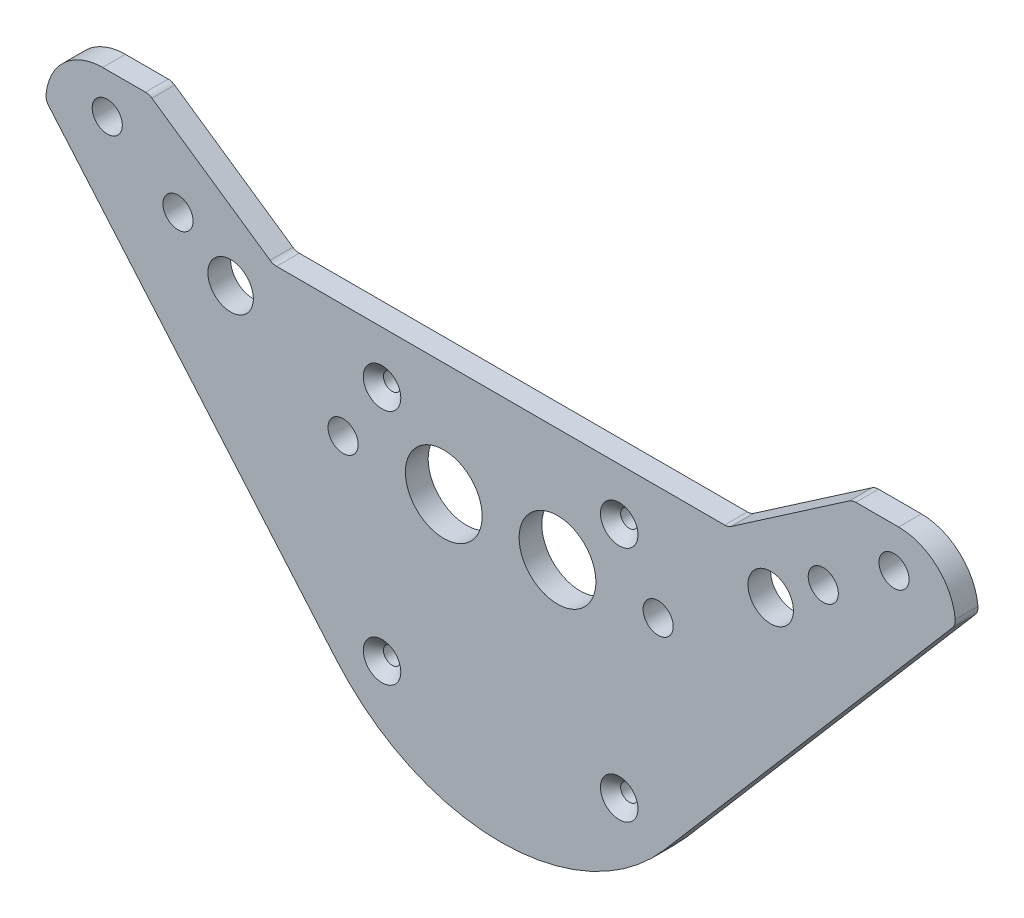
ISO-10303-21;
HEADER;
FILE_DESCRIPTION(('STEP AP214'),'2;1');
FILE_NAME('part.step','',(''),(''),'','','');
FILE_SCHEMA(('AUTOMOTIVE_DESIGN { 1 0 10303 214 1 1 1 1 }'));
ENDSEC;
DATA;
#1=APPLICATION_CONTEXT('core data for automotive mechanical design processes');
#2=APPLICATION_PROTOCOL_DEFINITION('international standard','automotive_design',2000,#1);
#3=PRODUCT_CONTEXT('',#1,'mechanical');
#4=PRODUCT('Part','Part','',(#3));
#5=PRODUCT_RELATED_PRODUCT_CATEGORY('part','',(#4));
#6=PRODUCT_DEFINITION_FORMATION('','',#4);
#7=PRODUCT_DEFINITION_CONTEXT('part definition',#1,'design');
#8=PRODUCT_DEFINITION('design','',#6,#7);
#9=PRODUCT_DEFINITION_SHAPE('','',#8);
#10=(LENGTH_UNIT() NAMED_UNIT(*) SI_UNIT(.MILLI.,.METRE.));
#11=(NAMED_UNIT(*) PLANE_ANGLE_UNIT() SI_UNIT($,.RADIAN.));
#12=(NAMED_UNIT(*) SI_UNIT($,.STERADIAN.) SOLID_ANGLE_UNIT());
#13=UNCERTAINTY_MEASURE_WITH_UNIT(LENGTH_MEASURE(1.E-05),#10,'distance_accuracy_value','');
#14=(GEOMETRIC_REPRESENTATION_CONTEXT(3) GLOBAL_UNCERTAINTY_ASSIGNED_CONTEXT((#13)) GLOBAL_UNIT_ASSIGNED_CONTEXT((#10,
#11,#12)) REPRESENTATION_CONTEXT('',''));
#15=CARTESIAN_POINT('',(0.,0.,0.));
#16=DIRECTION('',(0.,0.,1.));
#17=DIRECTION('',(1.,0.,0.));
#18=AXIS2_PLACEMENT_3D('',#15,#16,#17);
#19=CARTESIAN_POINT('',(0.,0.,4.));
#20=DIRECTION('',(0.,0.,-1.));
#21=DIRECTION('',(-1.,0.,0.));
#22=AXIS2_PLACEMENT_3D('',#19,#20,#21);
#23=PLANE('',#22);
#24=CARTESIAN_POINT('',(-20.8596500449861,35.8596500450032,4.));
#25=DIRECTION('',(0.,0.,1.));
#26=DIRECTION('',(1.,0.,0.));
#27=AXIS2_PLACEMENT_3D('',#24,#25,#26);
#28=CIRCLE('',#27,3.3);
#29=CARTESIAN_POINT('',(-17.5596500449861,35.8596500450032,4.));
#30=VERTEX_POINT('',#29);
#31=EDGE_CURVE('E707',#30,#30,#28,.T.);
#32=ORIENTED_EDGE('',*,*,#31,.F.);
#33=EDGE_LOOP('',(#32));
#34=FACE_BOUND('',#33,.T.);
#35=DIRECTION('',(-0.824081072987832,0.566471874979883,0.));
#36=VECTOR('',#35,1.);
#37=CARTESIAN_POINT('',(8.16153797644693,11.8730854432979,4.));
#38=LINE('',#37,#36);
#39=CARTESIAN_POINT('',(-40.5420383659888,45.3518378540244,4.));
#40=VERTEX_POINT('',#39);
#41=CARTESIAN_POINT('',(-61.3397704029264,59.6481621459757,4.));
#42=VERTEX_POINT('',#41);
#43=EDGE_CURVE('E211',#40,#42,#38,.T.);
#44=ORIENTED_EDGE('',*,*,#43,.T.);
#45=CARTESIAN_POINT('',(-62.4727141528862,58.,4.));
#46=DIRECTION('',(0.,0.,-1.));
#47=DIRECTION('',(-1.,0.,0.));
#48=AXIS2_PLACEMENT_3D('',#45,#46,#47);
#49=CIRCLE('',#48,2.);
#50=CARTESIAN_POINT('',(-62.4727141528862,60.,4.));
#51=VERTEX_POINT('',#50);
#52=EDGE_CURVE('E320',#42,#51,#49,.F.);
#53=ORIENTED_EDGE('',*,*,#52,.T.);
#54=DIRECTION('',(-1.,0.,0.));
#55=VECTOR('',#54,1.);
#56=CARTESIAN_POINT('',(-80.,60.,4.));
#57=LINE('',#56,#55);
#58=CARTESIAN_POINT('',(-70.,60.,4.));
#59=VERTEX_POINT('',#58);
#60=EDGE_CURVE('E279',#51,#59,#57,.T.);
#61=ORIENTED_EDGE('',*,*,#60,.T.);
#62=CARTESIAN_POINT('',(-70.,50.,4.));
#63=DIRECTION('',(0.,0.,-1.));
#64=DIRECTION('',(-1.,0.,0.));
#65=AXIS2_PLACEMENT_3D('',#62,#63,#64);
#66=CIRCLE('',#65,10.);
#67=CARTESIAN_POINT('',(-79.9612980681539,50.878943000082,4.));
#68=VERTEX_POINT('',#67);
#69=EDGE_CURVE('E292',#59,#68,#66,.F.);
#70=ORIENTED_EDGE('',*,*,#69,.T.);
#71=CARTESIAN_POINT('',(-77.9690384545231,50.7031544000656,4.));
#72=DIRECTION('',(0.,0.,-1.));
#73=DIRECTION('',(-1.,0.,0.));
#74=AXIS2_PLACEMENT_3D('',#71,#72,#73);
#75=CIRCLE('',#74,2.);
#76=CARTESIAN_POINT('',(-79.4881667854191,49.4022896437327,4.));
#77=VERTEX_POINT('',#76);
#78=EDGE_CURVE('E316',#68,#77,#75,.F.);
#79=ORIENTED_EDGE('',*,*,#78,.T.);
#80=DIRECTION('',(0.650432378166486,-0.759564165447982,0.));
#81=VECTOR('',#80,1.);
#82=CARTESIAN_POINT('',(-21.4527613894965,-18.3704961918243,4.));
#83=LINE('',#82,#81);
#84=CARTESIAN_POINT('',(-28.8634382870385,-9.71643037032659,4.));
#85=VERTEX_POINT('',#84);
#86=EDGE_CURVE('E180',#77,#85,#83,.T.);
#87=ORIENTED_EDGE('',*,*,#86,.T.);
#88=CARTESIAN_POINT('',(-1.51250539870418E-11,14.9999999999999,4.));
#89=DIRECTION('',(0.,0.,-1.));
#90=DIRECTION('',(-1.,0.,0.));
#91=AXIS2_PLACEMENT_3D('',#88,#89,#90);
#92=CIRCLE('',#91,38.);
#93=CARTESIAN_POINT('',(28.863438287001,-9.71643037033505,4.));
#94=VERTEX_POINT('',#93);
#95=EDGE_CURVE('E168',#85,#94,#92,.F.);
#96=ORIENTED_EDGE('',*,*,#95,.T.);
#97=DIRECTION('',(0.650432378166708,0.759564165447792,0.));
#98=VECTOR('',#97,1.);
#99=CARTESIAN_POINT('',(21.4527613894712,-18.3704961918135,4.));
#100=LINE('',#99,#98);
#101=CARTESIAN_POINT('',(79.4881667854187,49.4022896437326,4.));
#102=VERTEX_POINT('',#101);
#103=EDGE_CURVE('E184',#94,#102,#100,.T.);
#104=ORIENTED_EDGE('',*,*,#103,.T.);
#105=CARTESIAN_POINT('',(77.9690384545231,50.703154400066,4.));
#106=DIRECTION('',(0.,0.,-1.));
#107=DIRECTION('',(-1.,0.,0.));
#108=AXIS2_PLACEMENT_3D('',#105,#106,#107);
#109=CIRCLE('',#108,2.);
#110=CARTESIAN_POINT('',(79.9612980681539,50.8789430000825,4.));
#111=VERTEX_POINT('',#110);
#112=EDGE_CURVE('E318',#102,#111,#109,.F.);
#113=ORIENTED_EDGE('',*,*,#112,.T.);
#114=CARTESIAN_POINT('',(70.,50.,4.));
#115=DIRECTION('',(0.,0.,-1.));
#116=DIRECTION('',(-1.,0.,0.));
#117=AXIS2_PLACEMENT_3D('',#114,#115,#116);
#118=CIRCLE('',#117,10.);
#119=CARTESIAN_POINT('',(70.,60.,4.));
#120=VERTEX_POINT('',#119);
#121=EDGE_CURVE('E290',#111,#120,#118,.F.);
#122=ORIENTED_EDGE('',*,*,#121,.T.);
#123=CARTESIAN_POINT('',(62.4727141528861,60.,4.));
#124=VERTEX_POINT('',#123);
#125=EDGE_CURVE('E275',#120,#124,#57,.T.);
#126=ORIENTED_EDGE('',*,*,#125,.T.);
#127=CARTESIAN_POINT('',(62.4727141528862,58.,4.));
#128=DIRECTION('',(0.,0.,-1.));
#129=DIRECTION('',(-1.,0.,0.));
#130=AXIS2_PLACEMENT_3D('',#127,#128,#129);
#131=CIRCLE('',#130,2.);
#132=CARTESIAN_POINT('',(61.3397704029264,59.6481621459757,4.));
#133=VERTEX_POINT('',#132);
#134=EDGE_CURVE('E314',#124,#133,#131,.F.);
#135=ORIENTED_EDGE('',*,*,#134,.T.);
#136=DIRECTION('',(-0.824081072987832,-0.566471874979883,0.));
#137=VECTOR('',#136,1.);
#138=CARTESIAN_POINT('',(-8.16153797644693,11.8730854432979,4.));
#139=LINE('',#138,#137);
#140=CARTESIAN_POINT('',(40.5420383659888,45.3518378540244,4.));
#141=VERTEX_POINT('',#140);
#142=EDGE_CURVE('E207',#133,#141,#139,.T.);
#143=ORIENTED_EDGE('',*,*,#142,.T.);
#144=CARTESIAN_POINT('',(39.409094616029,47.,4.));
#145=DIRECTION('',(0.,0.,-1.));
#146=DIRECTION('',(-1.,0.,0.));
#147=AXIS2_PLACEMENT_3D('',#144,#145,#146);
#148=CIRCLE('',#147,2.);
#149=CARTESIAN_POINT('',(39.409094616029,45.,4.));
#150=VERTEX_POINT('',#149);
#151=EDGE_CURVE('E11',#141,#150,#148,.T.);
#152=ORIENTED_EDGE('',*,*,#151,.T.);
#153=DIRECTION('',(-1.,0.,0.));
#154=VECTOR('',#153,1.);
#155=CARTESIAN_POINT('',(0.,45.,4.));
#156=LINE('',#155,#154);
#157=CARTESIAN_POINT('',(-39.409094616029,45.,4.));
#158=VERTEX_POINT('',#157);
#159=EDGE_CURVE('E209',#150,#158,#156,.T.);
#160=ORIENTED_EDGE('',*,*,#159,.T.);
#161=CARTESIAN_POINT('',(-39.409094616029,47.,4.));
#162=DIRECTION('',(0.,0.,-1.));
#163=DIRECTION('',(-1.,0.,0.));
#164=AXIS2_PLACEMENT_3D('',#161,#162,#163);
#165=CIRCLE('',#164,2.);
#166=EDGE_CURVE('E343',#158,#40,#165,.T.);
#167=ORIENTED_EDGE('',*,*,#166,.T.);
#168=EDGE_LOOP('',(#44,#53,#61,#70,#79,#87,#96,#104,#113,#122,#126,#135,#143,#152,#160,#167));
#169=FACE_BOUND('',#168,.T.);
#170=CARTESIAN_POINT('',(47.4999999999405,37.9999999999996,4.));
#171=DIRECTION('',(0.,0.,-1.));
#172=DIRECTION('',(-1.,0.,0.));
#173=AXIS2_PLACEMENT_3D('',#170,#171,#172);
#174=CIRCLE('',#173,4.00000000000001);
#175=CARTESIAN_POINT('',(43.4999999999405,37.9999999999996,4.));
#176=VERTEX_POINT('',#175);
#177=EDGE_CURVE('E259',#176,#176,#174,.T.);
#178=ORIENTED_EDGE('',*,*,#177,.T.);
#179=EDGE_LOOP('',(#178));
#180=FACE_BOUND('',#179,.T.);
#181=CARTESIAN_POINT('',(56.7499214691148,44.5391273399938,4.));
#182=DIRECTION('',(0.,0.,-1.));
#183=DIRECTION('',(-1.,0.,0.));
#184=AXIS2_PLACEMENT_3D('',#181,#182,#183);
#185=CIRCLE('',#184,2.65000000000002);
#186=CARTESIAN_POINT('',(54.0999214691148,44.5391273399938,4.));
#187=VERTEX_POINT('',#186);
#188=EDGE_CURVE('E262',#187,#187,#185,.T.);
#189=ORIENTED_EDGE('',*,*,#188,.T.);
#190=EDGE_LOOP('',(#189));
#191=FACE_BOUND('',#190,.T.);
#192=CARTESIAN_POINT('',(69.1949044965658,52.9130390571341,4.));
#193=DIRECTION('',(0.,0.,-1.));
#194=DIRECTION('',(-1.,0.,0.));
#195=AXIS2_PLACEMENT_3D('',#192,#193,#194);
#196=CIRCLE('',#195,2.65000000000002);
#197=CARTESIAN_POINT('',(66.5449044965658,52.9130390571341,4.));
#198=VERTEX_POINT('',#197);
#199=EDGE_CURVE('E265',#198,#198,#196,.T.);
#200=ORIENTED_EDGE('',*,*,#199,.T.);
#201=EDGE_LOOP('',(#200));
#202=FACE_BOUND('',#201,.T.);
#203=CARTESIAN_POINT('',(27.711627738396,25.,4.));
#204=DIRECTION('',(0.,0.,-1.));
#205=DIRECTION('',(-1.,0.,0.));
#206=AXIS2_PLACEMENT_3D('',#203,#204,#205);
#207=CIRCLE('',#206,2.65000000000001);
#208=CARTESIAN_POINT('',(25.061627738396,25.,4.));
#209=VERTEX_POINT('',#208);
#210=EDGE_CURVE('E268',#209,#209,#207,.T.);
#211=ORIENTED_EDGE('',*,*,#210,.T.);
#212=EDGE_LOOP('',(#211));
#213=FACE_BOUND('',#212,.T.);
#214=CARTESIAN_POINT('',(9.99999999993936,25.,4.));
#215=DIRECTION('',(0.,0.,-1.));
#216=DIRECTION('',(-1.,0.,0.));
#217=AXIS2_PLACEMENT_3D('',#214,#215,#216);
#218=CIRCLE('',#217,6.75);
#219=CARTESIAN_POINT('',(3.24999999993936,25.,4.));
#220=VERTEX_POINT('',#219);
#221=EDGE_CURVE('E271',#220,#220,#218,.T.);
#222=ORIENTED_EDGE('',*,*,#221,.T.);
#223=EDGE_LOOP('',(#222));
#224=FACE_BOUND('',#223,.T.);
#225=CARTESIAN_POINT('',(-47.4999999999405,37.9999999999996,4.));
#226=DIRECTION('',(0.,0.,-1.));
#227=DIRECTION('',(-1.,0.,0.));
#228=AXIS2_PLACEMENT_3D('',#225,#226,#227);
#229=CIRCLE('',#228,4.00000000000001);
#230=CARTESIAN_POINT('',(-51.4999999999405,37.9999999999996,4.));
#231=VERTEX_POINT('',#230);
#232=EDGE_CURVE('E229',#231,#231,#229,.F.);
#233=ORIENTED_EDGE('',*,*,#232,.F.);
#234=EDGE_LOOP('',(#233));
#235=FACE_BOUND('',#234,.T.);
#236=CARTESIAN_POINT('',(-56.7499214691148,44.5391273399938,4.));
#237=DIRECTION('',(0.,0.,-1.));
#238=DIRECTION('',(-1.,0.,0.));
#239=AXIS2_PLACEMENT_3D('',#236,#237,#238);
#240=CIRCLE('',#239,2.65000000000002);
#241=CARTESIAN_POINT('',(-59.3999214691149,44.5391273399938,4.));
#242=VERTEX_POINT('',#241);
#243=EDGE_CURVE('E232',#242,#242,#240,.F.);
#244=ORIENTED_EDGE('',*,*,#243,.F.);
#245=EDGE_LOOP('',(#244));
#246=FACE_BOUND('',#245,.T.);
#247=CARTESIAN_POINT('',(-69.1949044965658,52.9130390571341,4.));
#248=DIRECTION('',(0.,0.,-1.));
#249=DIRECTION('',(-1.,0.,0.));
#250=AXIS2_PLACEMENT_3D('',#247,#248,#249);
#251=CIRCLE('',#250,2.65000000000002);
#252=CARTESIAN_POINT('',(-71.8449044965658,52.9130390571341,4.));
#253=VERTEX_POINT('',#252);
#254=EDGE_CURVE('E235',#253,#253,#251,.F.);
#255=ORIENTED_EDGE('',*,*,#254,.F.);
#256=EDGE_LOOP('',(#255));
#257=FACE_BOUND('',#256,.T.);
#258=CARTESIAN_POINT('',(-27.711627738396,25.,4.));
#259=DIRECTION('',(0.,0.,-1.));
#260=DIRECTION('',(-1.,0.,0.));
#261=AXIS2_PLACEMENT_3D('',#258,#259,#260);
#262=CIRCLE('',#261,2.65000000000001);
#263=CARTESIAN_POINT('',(-30.361627738396,25.,4.));
#264=VERTEX_POINT('',#263);
#265=EDGE_CURVE('E238',#264,#264,#262,.F.);
#266=ORIENTED_EDGE('',*,*,#265,.F.);
#267=EDGE_LOOP('',(#266));
#268=FACE_BOUND('',#267,.T.);
#269=CARTESIAN_POINT('',(-9.99999999993936,25.,4.));
#270=DIRECTION('',(0.,0.,-1.));
#271=DIRECTION('',(-1.,0.,0.));
#272=AXIS2_PLACEMENT_3D('',#269,#270,#271);
#273=CIRCLE('',#272,6.75);
#274=CARTESIAN_POINT('',(-16.7499999999394,25.,4.));
#275=VERTEX_POINT('',#274);
#276=EDGE_CURVE('E241',#275,#275,#273,.F.);
#277=ORIENTED_EDGE('',*,*,#276,.F.);
#278=EDGE_LOOP('',(#277));
#279=FACE_BOUND('',#278,.T.);
#280=CARTESIAN_POINT('',(-20.8596500449864,-5.85965004500312,4.));
#281=DIRECTION('',(0.,0.,1.));
#282=DIRECTION('',(1.,0.,0.));
#283=AXIS2_PLACEMENT_3D('',#280,#281,#282);
#284=CIRCLE('',#283,3.3);
#285=CARTESIAN_POINT('',(-17.5596500449864,-5.85965004500312,4.));
#286=VERTEX_POINT('',#285);
#287=EDGE_CURVE('E723',#286,#286,#284,.T.);
#288=ORIENTED_EDGE('',*,*,#287,.F.);
#289=EDGE_LOOP('',(#288));
#290=FACE_BOUND('',#289,.T.);
#291=CARTESIAN_POINT('',(20.8596500449864,-5.85965004500312,4.));
#292=DIRECTION('',(0.,0.,1.));
#293=DIRECTION('',(1.,0.,0.));
#294=AXIS2_PLACEMENT_3D('',#291,#292,#293);
#295=CIRCLE('',#294,3.3);
#296=CARTESIAN_POINT('',(24.1596500449864,-5.85965004500312,4.));
#297=VERTEX_POINT('',#296);
#298=EDGE_CURVE('E717',#297,#297,#295,.T.);
#299=ORIENTED_EDGE('',*,*,#298,.F.);
#300=EDGE_LOOP('',(#299));
#301=FACE_BOUND('',#300,.T.);
#302=CARTESIAN_POINT('',(20.8596500449861,35.8596500450032,4.));
#303=DIRECTION('',(0.,0.,1.));
#304=DIRECTION('',(1.,0.,0.));
#305=AXIS2_PLACEMENT_3D('',#302,#303,#304);
#306=CIRCLE('',#305,3.3);
#307=CARTESIAN_POINT('',(24.1596500449861,35.8596500450032,4.));
#308=VERTEX_POINT('',#307);
#309=EDGE_CURVE('E709',#308,#308,#306,.T.);
#310=ORIENTED_EDGE('',*,*,#309,.F.);
#311=EDGE_LOOP('',(#310));
#312=FACE_BOUND('',#311,.T.);
#313=ADVANCED_FACE('F35',(#34,#169,#180,#191,#202,#213,#224,#235,#246,#257,#268,#279,#290,#301,
#312),#23,.F.);
#314=CARTESIAN_POINT('',(-80.,60.,4.));
#315=DIRECTION('',(0.,-1.,0.));
#316=DIRECTION('',(0.,0.,-1.));
#317=AXIS2_PLACEMENT_3D('',#314,#315,#316);
#318=PLANE('',#317);
#319=ORIENTED_EDGE('',*,*,#60,.F.);
#320=DIRECTION('',(0.,0.,-1.));
#321=VECTOR('',#320,1.);
#322=CARTESIAN_POINT('',(-62.4727141528862,60.,4.));
#323=LINE('',#322,#321);
#324=CARTESIAN_POINT('',(-62.4727141528862,60.,0.));
#325=VERTEX_POINT('',#324);
#326=EDGE_CURVE('E298',#51,#325,#323,.T.);
#327=ORIENTED_EDGE('',*,*,#326,.T.);
#328=DIRECTION('',(-1.,0.,0.));
#329=VECTOR('',#328,1.);
#330=CARTESIAN_POINT('',(-80.,60.,0.));
#331=LINE('',#330,#329);
#332=CARTESIAN_POINT('',(-70.,60.,0.));
#333=VERTEX_POINT('',#332);
#334=EDGE_CURVE('E274',#325,#333,#331,.T.);
#335=ORIENTED_EDGE('',*,*,#334,.T.);
#336=DIRECTION('',(0.,0.,-1.));
#337=VECTOR('',#336,1.);
#338=CARTESIAN_POINT('',(-70.,60.,4.));
#339=LINE('',#338,#337);
#340=EDGE_CURVE('E287',#333,#59,#339,.F.);
#341=ORIENTED_EDGE('',*,*,#340,.T.);
#342=EDGE_LOOP('',(#319,#327,#335,#341));
#343=FACE_BOUND('',#342,.T.);
#344=ADVANCED_FACE('F372',(#343),#318,.F.);
#345=CARTESIAN_POINT('',(70.,60.,0.));
#346=VERTEX_POINT('',#345);
#347=CARTESIAN_POINT('',(62.4727141528861,60.,0.));
#348=VERTEX_POINT('',#347);
#349=EDGE_CURVE('E280',#346,#348,#331,.T.);
#350=ORIENTED_EDGE('',*,*,#349,.T.);
#351=DIRECTION('',(0.,0.,-1.));
#352=VECTOR('',#351,1.);
#353=CARTESIAN_POINT('',(62.4727141528861,60.,4.));
#354=LINE('',#353,#352);
#355=EDGE_CURVE('E339',#348,#124,#354,.F.);
#356=ORIENTED_EDGE('',*,*,#355,.T.);
#357=ORIENTED_EDGE('',*,*,#125,.F.);
#358=DIRECTION('',(0.,0.,-1.));
#359=VECTOR('',#358,1.);
#360=CARTESIAN_POINT('',(70.,60.,4.));
#361=LINE('',#360,#359);
#362=EDGE_CURVE('E295',#120,#346,#361,.T.);
#363=ORIENTED_EDGE('',*,*,#362,.T.);
#364=EDGE_LOOP('',(#350,#356,#357,#363));
#365=FACE_BOUND('',#364,.T.);
#366=ADVANCED_FACE('F401',(#365),#318,.F.);
#367=CARTESIAN_POINT('',(0.,0.,0.));
#368=DIRECTION('',(0.,0.,-1.));
#369=DIRECTION('',(-1.,0.,0.));
#370=AXIS2_PLACEMENT_3D('',#367,#368,#369);
#371=PLANE('',#370);
#372=ORIENTED_EDGE('',*,*,#334,.F.);
#373=CARTESIAN_POINT('',(-62.4727141528862,58.,0.));
#374=DIRECTION('',(0.,0.,-1.));
#375=DIRECTION('',(-1.,0.,0.));
#376=AXIS2_PLACEMENT_3D('',#373,#374,#375);
#377=CIRCLE('',#376,2.);
#378=CARTESIAN_POINT('',(-61.3397704029264,59.6481621459757,0.));
#379=VERTEX_POINT('',#378);
#380=EDGE_CURVE('E307',#325,#379,#377,.T.);
#381=ORIENTED_EDGE('',*,*,#380,.T.);
#382=DIRECTION('',(-0.824081072987832,0.566471874979883,0.));
#383=VECTOR('',#382,1.);
#384=CARTESIAN_POINT('',(-61.8516103177896,60.,0.));
#385=LINE('',#384,#383);
#386=CARTESIAN_POINT('',(-40.5420383659888,45.3518378540244,0.));
#387=VERTEX_POINT('',#386);
#388=EDGE_CURVE('E204',#387,#379,#385,.T.);
#389=ORIENTED_EDGE('',*,*,#388,.F.);
#390=CARTESIAN_POINT('',(-39.409094616029,47.,0.));
#391=DIRECTION('',(0.,0.,-1.));
#392=DIRECTION('',(-1.,0.,0.));
#393=AXIS2_PLACEMENT_3D('',#390,#391,#392);
#394=CIRCLE('',#393,2.);
#395=CARTESIAN_POINT('',(-39.409094616029,45.,0.));
#396=VERTEX_POINT('',#395);
#397=EDGE_CURVE('E341',#387,#396,#394,.F.);
#398=ORIENTED_EDGE('',*,*,#397,.T.);
#399=DIRECTION('',(-1.,0.,0.));
#400=VECTOR('',#399,1.);
#401=CARTESIAN_POINT('',(40.0301984511256,45.,0.));
#402=LINE('',#401,#400);
#403=CARTESIAN_POINT('',(39.409094616029,45.,0.));
#404=VERTEX_POINT('',#403);
#405=EDGE_CURVE('E202',#404,#396,#402,.T.);
#406=ORIENTED_EDGE('',*,*,#405,.F.);
#407=CARTESIAN_POINT('',(39.409094616029,47.,0.));
#408=DIRECTION('',(0.,0.,-1.));
#409=DIRECTION('',(-1.,0.,0.));
#410=AXIS2_PLACEMENT_3D('',#407,#408,#409);
#411=CIRCLE('',#410,2.);
#412=CARTESIAN_POINT('',(40.5420383659888,45.3518378540244,0.));
#413=VERTEX_POINT('',#412);
#414=EDGE_CURVE('E43',#404,#413,#411,.F.);
#415=ORIENTED_EDGE('',*,*,#414,.T.);
#416=DIRECTION('',(-0.824081072987832,-0.566471874979883,0.));
#417=VECTOR('',#416,1.);
#418=CARTESIAN_POINT('',(61.8516103177896,60.,0.));
#419=LINE('',#418,#417);
#420=CARTESIAN_POINT('',(61.3397704029264,59.6481621459757,0.));
#421=VERTEX_POINT('',#420);
#422=EDGE_CURVE('E199',#421,#413,#419,.T.);
#423=ORIENTED_EDGE('',*,*,#422,.F.);
#424=CARTESIAN_POINT('',(62.4727141528862,58.,0.));
#425=DIRECTION('',(0.,0.,-1.));
#426=DIRECTION('',(-1.,0.,0.));
#427=AXIS2_PLACEMENT_3D('',#424,#425,#426);
#428=CIRCLE('',#427,2.);
#429=EDGE_CURVE('E301',#421,#348,#428,.T.);
#430=ORIENTED_EDGE('',*,*,#429,.T.);
#431=ORIENTED_EDGE('',*,*,#349,.F.);
#432=CARTESIAN_POINT('',(70.,50.,0.));
#433=DIRECTION('',(0.,0.,-1.));
#434=DIRECTION('',(-1.,0.,0.));
#435=AXIS2_PLACEMENT_3D('',#432,#433,#434);
#436=CIRCLE('',#435,10.);
#437=CARTESIAN_POINT('',(79.9612980681539,50.8789430000825,0.));
#438=VERTEX_POINT('',#437);
#439=EDGE_CURVE('E278',#346,#438,#436,.T.);
#440=ORIENTED_EDGE('',*,*,#439,.T.);
#441=CARTESIAN_POINT('',(77.9690384545231,50.703154400066,0.));
#442=DIRECTION('',(0.,0.,-1.));
#443=DIRECTION('',(-1.,0.,0.));
#444=AXIS2_PLACEMENT_3D('',#441,#442,#443);
#445=CIRCLE('',#444,2.);
#446=CARTESIAN_POINT('',(79.4881667854187,49.4022896437326,0.));
#447=VERTEX_POINT('',#446);
#448=EDGE_CURVE('E305',#438,#447,#445,.T.);
#449=ORIENTED_EDGE('',*,*,#448,.T.);
#450=DIRECTION('',(0.650432378166708,0.759564165447792,0.));
#451=VECTOR('',#450,1.);
#452=CARTESIAN_POINT('',(80.,50.,0.));
#453=LINE('',#452,#451);
#454=CARTESIAN_POINT('',(28.863438287001,-9.71643037033505,0.));
#455=VERTEX_POINT('',#454);
#456=EDGE_CURVE('E170',#455,#447,#453,.T.);
#457=ORIENTED_EDGE('',*,*,#456,.F.);
#458=CARTESIAN_POINT('',(-1.51250539870418E-11,14.9999999999999,0.));
#459=DIRECTION('',(0.,0.,1.));
#460=DIRECTION('',(-1.,0.,0.));
#461=AXIS2_PLACEMENT_3D('',#458,#459,#460);
#462=CIRCLE('',#461,38.);
#463=CARTESIAN_POINT('',(-28.8634382870385,-9.71643037032659,0.));
#464=VERTEX_POINT('',#463);
#465=EDGE_CURVE('E158',#464,#455,#462,.T.);
#466=ORIENTED_EDGE('',*,*,#465,.F.);
#467=DIRECTION('',(0.650432378166486,-0.759564165447982,0.));
#468=VECTOR('',#467,1.);
#469=CARTESIAN_POINT('',(-28.8634382870385,-9.71643037032658,0.));
#470=LINE('',#469,#468);
#471=CARTESIAN_POINT('',(-79.4881667854191,49.4022896437327,0.));
#472=VERTEX_POINT('',#471);
#473=EDGE_CURVE('E149',#472,#464,#470,.T.);
#474=ORIENTED_EDGE('',*,*,#473,.F.);
#475=CARTESIAN_POINT('',(-77.9690384545231,50.7031544000656,0.));
#476=DIRECTION('',(0.,0.,-1.));
#477=DIRECTION('',(-1.,0.,0.));
#478=AXIS2_PLACEMENT_3D('',#475,#476,#477);
#479=CIRCLE('',#478,2.);
#480=CARTESIAN_POINT('',(-79.9612980681539,50.878943000082,0.));
#481=VERTEX_POINT('',#480);
#482=EDGE_CURVE('E303',#472,#481,#479,.T.);
#483=ORIENTED_EDGE('',*,*,#482,.T.);
#484=CARTESIAN_POINT('',(-70.,50.,0.));
#485=DIRECTION('',(0.,0.,-1.));
#486=DIRECTION('',(-1.,0.,0.));
#487=AXIS2_PLACEMENT_3D('',#484,#485,#486);
#488=CIRCLE('',#487,10.);
#489=EDGE_CURVE('E285',#481,#333,#488,.T.);
#490=ORIENTED_EDGE('',*,*,#489,.T.);
#491=EDGE_LOOP('',(#372,#381,#389,#398,#406,#415,#423,#430,#431,#440,#449,#457,#466,#474,#483,#490));
#492=FACE_BOUND('',#491,.T.);
#493=CARTESIAN_POINT('',(-20.8596500449861,35.8596500450032,0.));
#494=DIRECTION('',(0.,0.,-1.));
#495=DIRECTION('',(1.,0.,0.));
#496=AXIS2_PLACEMENT_3D('',#493,#494,#495);
#497=CIRCLE('',#496,1.52500000005576);
#498=CARTESIAN_POINT('',(-19.3346500449303,35.8596500450032,0.));
#499=VERTEX_POINT('',#498);
#500=EDGE_CURVE('E187',#499,#499,#497,.T.);
#501=ORIENTED_EDGE('',*,*,#500,.F.);
#502=EDGE_LOOP('',(#501));
#503=FACE_BOUND('',#502,.T.);
#504=CARTESIAN_POINT('',(-20.8596500449864,-5.85965004500312,0.));
#505=DIRECTION('',(0.,0.,-1.));
#506=DIRECTION('',(1.,0.,0.));
#507=AXIS2_PLACEMENT_3D('',#504,#505,#506);
#508=CIRCLE('',#507,1.52500000005577);
#509=CARTESIAN_POINT('',(-19.3346500449306,-5.85965004500312,0.));
#510=VERTEX_POINT('',#509);
#511=EDGE_CURVE('E192',#510,#510,#508,.T.);
#512=ORIENTED_EDGE('',*,*,#511,.F.);
#513=EDGE_LOOP('',(#512));
#514=FACE_BOUND('',#513,.T.);
#515=CARTESIAN_POINT('',(20.8596500449864,-5.85965004500312,0.));
#516=DIRECTION('',(0.,0.,-1.));
#517=DIRECTION('',(-1.,0.,0.));
#518=AXIS2_PLACEMENT_3D('',#515,#516,#517);
#519=CIRCLE('',#518,1.52500000005577);
#520=CARTESIAN_POINT('',(19.3346500449306,-5.85965004500312,0.));
#521=VERTEX_POINT('',#520);
#522=EDGE_CURVE('E188',#521,#521,#519,.T.);
#523=ORIENTED_EDGE('',*,*,#522,.F.);
#524=EDGE_LOOP('',(#523));
#525=FACE_BOUND('',#524,.T.);
#526=CARTESIAN_POINT('',(20.8596500449861,35.8596500450032,0.));
#527=DIRECTION('',(0.,0.,-1.));
#528=DIRECTION('',(-1.,0.,0.));
#529=AXIS2_PLACEMENT_3D('',#526,#527,#528);
#530=CIRCLE('',#529,1.52500000005576);
#531=CARTESIAN_POINT('',(19.3346500449303,35.8596500450032,0.));
#532=VERTEX_POINT('',#531);
#533=EDGE_CURVE('E191',#532,#532,#530,.T.);
#534=ORIENTED_EDGE('',*,*,#533,.F.);
#535=EDGE_LOOP('',(#534));
#536=FACE_BOUND('',#535,.T.);
#537=CARTESIAN_POINT('',(-9.99999999993936,25.,0.));
#538=DIRECTION('',(0.,0.,1.));
#539=DIRECTION('',(1.,0.,0.));
#540=AXIS2_PLACEMENT_3D('',#537,#538,#539);
#541=CIRCLE('',#540,6.75);
#542=CARTESIAN_POINT('',(-3.24999999993936,25.,0.));
#543=VERTEX_POINT('',#542);
#544=EDGE_CURVE('E214',#543,#543,#541,.T.);
#545=ORIENTED_EDGE('',*,*,#544,.T.);
#546=EDGE_LOOP('',(#545));
#547=FACE_BOUND('',#546,.T.);
#548=CARTESIAN_POINT('',(-27.711627738396,25.,0.));
#549=DIRECTION('',(0.,0.,1.));
#550=DIRECTION('',(1.,0.,0.));
#551=AXIS2_PLACEMENT_3D('',#548,#549,#550);
#552=CIRCLE('',#551,2.65000000000001);
#553=CARTESIAN_POINT('',(-25.061627738396,25.,0.));
#554=VERTEX_POINT('',#553);
#555=EDGE_CURVE('E222',#554,#554,#552,.T.);
#556=ORIENTED_EDGE('',*,*,#555,.T.);
#557=EDGE_LOOP('',(#556));
#558=FACE_BOUND('',#557,.T.);
#559=CARTESIAN_POINT('',(-69.1949044965658,52.9130390571341,0.));
#560=DIRECTION('',(0.,0.,1.));
#561=DIRECTION('',(1.,0.,0.));
#562=AXIS2_PLACEMENT_3D('',#559,#560,#561);
#563=CIRCLE('',#562,2.65000000000002);
#564=CARTESIAN_POINT('',(-66.5449044965658,52.9130390571341,0.));
#565=VERTEX_POINT('',#564);
#566=EDGE_CURVE('E219',#565,#565,#563,.T.);
#567=ORIENTED_EDGE('',*,*,#566,.T.);
#568=EDGE_LOOP('',(#567));
#569=FACE_BOUND('',#568,.T.);
#570=CARTESIAN_POINT('',(-56.7499214691148,44.5391273399938,0.));
#571=DIRECTION('',(0.,0.,1.));
#572=DIRECTION('',(1.,0.,0.));
#573=AXIS2_PLACEMENT_3D('',#570,#571,#572);
#574=CIRCLE('',#573,2.65000000000002);
#575=CARTESIAN_POINT('',(-54.0999214691148,44.5391273399938,0.));
#576=VERTEX_POINT('',#575);
#577=EDGE_CURVE('E215',#576,#576,#574,.T.);
#578=ORIENTED_EDGE('',*,*,#577,.T.);
#579=EDGE_LOOP('',(#578));
#580=FACE_BOUND('',#579,.T.);
#581=CARTESIAN_POINT('',(-47.4999999999405,37.9999999999996,0.));
#582=DIRECTION('',(0.,0.,1.));
#583=DIRECTION('',(1.,0.,0.));
#584=AXIS2_PLACEMENT_3D('',#581,#582,#583);
#585=CIRCLE('',#584,4.00000000000001);
#586=CARTESIAN_POINT('',(-43.4999999999405,37.9999999999996,0.));
#587=VERTEX_POINT('',#586);
#588=EDGE_CURVE('E218',#587,#587,#585,.T.);
#589=ORIENTED_EDGE('',*,*,#588,.T.);
#590=EDGE_LOOP('',(#589));
#591=FACE_BOUND('',#590,.T.);
#592=CARTESIAN_POINT('',(9.99999999993936,25.,0.));
#593=DIRECTION('',(0.,0.,-1.));
#594=DIRECTION('',(-1.,0.,0.));
#595=AXIS2_PLACEMENT_3D('',#592,#593,#594);
#596=CIRCLE('',#595,6.75);
#597=CARTESIAN_POINT('',(3.24999999993936,25.,0.));
#598=VERTEX_POINT('',#597);
#599=EDGE_CURVE('E244',#598,#598,#596,.T.);
#600=ORIENTED_EDGE('',*,*,#599,.F.);
#601=EDGE_LOOP('',(#600));
#602=FACE_BOUND('',#601,.T.);
#603=CARTESIAN_POINT('',(27.711627738396,25.,0.));
#604=DIRECTION('',(0.,0.,-1.));
#605=DIRECTION('',(-1.,0.,0.));
#606=AXIS2_PLACEMENT_3D('',#603,#604,#605);
#607=CIRCLE('',#606,2.65000000000001);
#608=CARTESIAN_POINT('',(25.061627738396,25.,0.));
#609=VERTEX_POINT('',#608);
#610=EDGE_CURVE('E252',#609,#609,#607,.T.);
#611=ORIENTED_EDGE('',*,*,#610,.F.);
#612=EDGE_LOOP('',(#611));
#613=FACE_BOUND('',#612,.T.);
#614=CARTESIAN_POINT('',(69.1949044965658,52.9130390571341,0.));
#615=DIRECTION('',(0.,0.,-1.));
#616=DIRECTION('',(-1.,0.,0.));
#617=AXIS2_PLACEMENT_3D('',#614,#615,#616);
#618=CIRCLE('',#617,2.65000000000002);
#619=CARTESIAN_POINT('',(66.5449044965658,52.9130390571341,0.));
#620=VERTEX_POINT('',#619);
#621=EDGE_CURVE('E249',#620,#620,#618,.T.);
#622=ORIENTED_EDGE('',*,*,#621,.F.);
#623=EDGE_LOOP('',(#622));
#624=FACE_BOUND('',#623,.T.);
#625=CARTESIAN_POINT('',(56.7499214691148,44.5391273399938,0.));
#626=DIRECTION('',(0.,0.,-1.));
#627=DIRECTION('',(-1.,0.,0.));
#628=AXIS2_PLACEMENT_3D('',#625,#626,#627);
#629=CIRCLE('',#628,2.65000000000002);
#630=CARTESIAN_POINT('',(54.0999214691148,44.5391273399938,0.));
#631=VERTEX_POINT('',#630);
#632=EDGE_CURVE('E245',#631,#631,#629,.T.);
#633=ORIENTED_EDGE('',*,*,#632,.F.);
#634=EDGE_LOOP('',(#633));
#635=FACE_BOUND('',#634,.T.);
#636=CARTESIAN_POINT('',(47.4999999999405,37.9999999999996,0.));
#637=DIRECTION('',(0.,0.,-1.));
#638=DIRECTION('',(-1.,0.,0.));
#639=AXIS2_PLACEMENT_3D('',#636,#637,#638);
#640=CIRCLE('',#639,4.00000000000001);
#641=CARTESIAN_POINT('',(43.4999999999405,37.9999999999996,0.));
#642=VERTEX_POINT('',#641);
#643=EDGE_CURVE('E248',#642,#642,#640,.T.);
#644=ORIENTED_EDGE('',*,*,#643,.F.);
#645=EDGE_LOOP('',(#644));
#646=FACE_BOUND('',#645,.T.);
#647=ADVANCED_FACE('F173',(#492,#503,#514,#525,#536,#547,#558,#569,#580,#591,#602,#613,#624,
#635,#646),#371,.T.);
#648=CARTESIAN_POINT('',(47.4999999999405,37.9999999999996,24.));
#649=DIRECTION('',(0.,0.,-1.));
#650=DIRECTION('',(-1.,0.,0.));
#651=AXIS2_PLACEMENT_3D('',#648,#649,#650);
#652=CYLINDRICAL_SURFACE('',#651,4.00000000000001);
#653=ORIENTED_EDGE('',*,*,#643,.T.);
#654=EDGE_LOOP('',(#653));
#655=FACE_BOUND('',#654,.T.);
#656=ORIENTED_EDGE('',*,*,#177,.F.);
#657=EDGE_LOOP('',(#656));
#658=FACE_BOUND('',#657,.T.);
#659=ADVANCED_FACE('F405',(#655,#658),#652,.F.);
#660=CARTESIAN_POINT('',(56.7499214691148,44.5391273399938,24.));
#661=DIRECTION('',(0.,0.,-1.));
#662=DIRECTION('',(-1.,0.,0.));
#663=AXIS2_PLACEMENT_3D('',#660,#661,#662);
#664=CYLINDRICAL_SURFACE('',#663,2.65000000000002);
#665=ORIENTED_EDGE('',*,*,#632,.T.);
#666=EDGE_LOOP('',(#665));
#667=FACE_BOUND('',#666,.T.);
#668=ORIENTED_EDGE('',*,*,#188,.F.);
#669=EDGE_LOOP('',(#668));
#670=FACE_BOUND('',#669,.T.);
#671=ADVANCED_FACE('F558',(#667,#670),#664,.F.);
#672=CARTESIAN_POINT('',(69.1949044965658,52.9130390571341,24.));
#673=DIRECTION('',(0.,0.,-1.));
#674=DIRECTION('',(-1.,0.,0.));
#675=AXIS2_PLACEMENT_3D('',#672,#673,#674);
#676=CYLINDRICAL_SURFACE('',#675,2.65000000000002);
#677=ORIENTED_EDGE('',*,*,#621,.T.);
#678=EDGE_LOOP('',(#677));
#679=FACE_BOUND('',#678,.T.);
#680=ORIENTED_EDGE('',*,*,#199,.F.);
#681=EDGE_LOOP('',(#680));
#682=FACE_BOUND('',#681,.T.);
#683=ADVANCED_FACE('F564',(#679,#682),#676,.F.);
#684=CARTESIAN_POINT('',(27.711627738396,25.,24.));
#685=DIRECTION('',(0.,0.,-1.));
#686=DIRECTION('',(-1.,0.,0.));
#687=AXIS2_PLACEMENT_3D('',#684,#685,#686);
#688=CYLINDRICAL_SURFACE('',#687,2.65000000000001);
#689=ORIENTED_EDGE('',*,*,#610,.T.);
#690=EDGE_LOOP('',(#689));
#691=FACE_BOUND('',#690,.T.);
#692=ORIENTED_EDGE('',*,*,#210,.F.);
#693=EDGE_LOOP('',(#692));
#694=FACE_BOUND('',#693,.T.);
#695=ADVANCED_FACE('F572',(#691,#694),#688,.F.);
#696=CARTESIAN_POINT('',(9.99999999993936,25.,24.));
#697=DIRECTION('',(0.,0.,-1.));
#698=DIRECTION('',(-1.,0.,0.));
#699=AXIS2_PLACEMENT_3D('',#696,#697,#698);
#700=CYLINDRICAL_SURFACE('',#699,6.75);
#701=ORIENTED_EDGE('',*,*,#599,.T.);
#702=EDGE_LOOP('',(#701));
#703=FACE_BOUND('',#702,.T.);
#704=ORIENTED_EDGE('',*,*,#221,.F.);
#705=EDGE_LOOP('',(#704));
#706=FACE_BOUND('',#705,.T.);
#707=ADVANCED_FACE('F580',(#703,#706),#700,.F.);
#708=CARTESIAN_POINT('',(-47.4999999999405,37.9999999999996,24.));
#709=DIRECTION('',(0.,0.,-1.));
#710=DIRECTION('',(-1.,0.,0.));
#711=AXIS2_PLACEMENT_3D('',#708,#709,#710);
#712=CYLINDRICAL_SURFACE('',#711,4.00000000000001);
#713=ORIENTED_EDGE('',*,*,#588,.F.);
#714=EDGE_LOOP('',(#713));
#715=FACE_BOUND('',#714,.T.);
#716=ORIENTED_EDGE('',*,*,#232,.T.);
#717=EDGE_LOOP('',(#716));
#718=FACE_BOUND('',#717,.T.);
#719=ADVANCED_FACE('F588',(#715,#718),#712,.F.);
#720=CARTESIAN_POINT('',(-56.7499214691148,44.5391273399938,24.));
#721=DIRECTION('',(0.,0.,-1.));
#722=DIRECTION('',(-1.,0.,0.));
#723=AXIS2_PLACEMENT_3D('',#720,#721,#722);
#724=CYLINDRICAL_SURFACE('',#723,2.65000000000002);
#725=ORIENTED_EDGE('',*,*,#577,.F.);
#726=EDGE_LOOP('',(#725));
#727=FACE_BOUND('',#726,.T.);
#728=ORIENTED_EDGE('',*,*,#243,.T.);
#729=EDGE_LOOP('',(#728));
#730=FACE_BOUND('',#729,.T.);
#731=ADVANCED_FACE('F595',(#727,#730),#724,.F.);
#732=CARTESIAN_POINT('',(-69.1949044965658,52.9130390571341,24.));
#733=DIRECTION('',(0.,0.,-1.));
#734=DIRECTION('',(-1.,0.,0.));
#735=AXIS2_PLACEMENT_3D('',#732,#733,#734);
#736=CYLINDRICAL_SURFACE('',#735,2.65000000000002);
#737=ORIENTED_EDGE('',*,*,#566,.F.);
#738=EDGE_LOOP('',(#737));
#739=FACE_BOUND('',#738,.T.);
#740=ORIENTED_EDGE('',*,*,#254,.T.);
#741=EDGE_LOOP('',(#740));
#742=FACE_BOUND('',#741,.T.);
#743=ADVANCED_FACE('F603',(#739,#742),#736,.F.);
#744=CARTESIAN_POINT('',(-27.711627738396,25.,24.));
#745=DIRECTION('',(0.,0.,-1.));
#746=DIRECTION('',(-1.,0.,0.));
#747=AXIS2_PLACEMENT_3D('',#744,#745,#746);
#748=CYLINDRICAL_SURFACE('',#747,2.65000000000001);
#749=ORIENTED_EDGE('',*,*,#555,.F.);
#750=EDGE_LOOP('',(#749));
#751=FACE_BOUND('',#750,.T.);
#752=ORIENTED_EDGE('',*,*,#265,.T.);
#753=EDGE_LOOP('',(#752));
#754=FACE_BOUND('',#753,.T.);
#755=ADVANCED_FACE('F611',(#751,#754),#748,.F.);
#756=CARTESIAN_POINT('',(-9.99999999993936,25.,24.));
#757=DIRECTION('',(0.,0.,-1.));
#758=DIRECTION('',(-1.,0.,0.));
#759=AXIS2_PLACEMENT_3D('',#756,#757,#758);
#760=CYLINDRICAL_SURFACE('',#759,6.75);
#761=ORIENTED_EDGE('',*,*,#544,.F.);
#762=EDGE_LOOP('',(#761));
#763=FACE_BOUND('',#762,.T.);
#764=ORIENTED_EDGE('',*,*,#276,.T.);
#765=EDGE_LOOP('',(#764));
#766=FACE_BOUND('',#765,.T.);
#767=ADVANCED_FACE('F528',(#763,#766),#760,.F.);
#768=CARTESIAN_POINT('',(-61.8516103177896,60.,54.));
#769=DIRECTION('',(-0.566471874979883,-0.824081072987832,0.));
#770=DIRECTION('',(0.824081072987832,-0.566471874979883,0.));
#771=AXIS2_PLACEMENT_3D('',#768,#769,#770);
#772=PLANE('',#771);
#773=ORIENTED_EDGE('',*,*,#388,.T.);
#774=DIRECTION('',(0.,0.,-1.));
#775=VECTOR('',#774,1.);
#776=CARTESIAN_POINT('',(-61.3397704029264,59.6481621459757,54.));
#777=LINE('',#776,#775);
#778=EDGE_CURVE('E312',#379,#42,#777,.F.);
#779=ORIENTED_EDGE('',*,*,#778,.T.);
#780=ORIENTED_EDGE('',*,*,#43,.F.);
#781=DIRECTION('',(0.,0.,-1.));
#782=VECTOR('',#781,1.);
#783=CARTESIAN_POINT('',(-40.5420383659888,45.3518378540244,0.));
#784=LINE('',#783,#782);
#785=EDGE_CURVE('E309',#40,#387,#784,.T.);
#786=ORIENTED_EDGE('',*,*,#785,.T.);
#787=EDGE_LOOP('',(#773,#779,#780,#786));
#788=FACE_BOUND('',#787,.T.);
#789=ADVANCED_FACE('F363',(#788),#772,.F.);
#790=CARTESIAN_POINT('',(40.0301984511256,45.,54.));
#791=DIRECTION('',(0.,-1.,0.));
#792=DIRECTION('',(1.,0.,0.));
#793=AXIS2_PLACEMENT_3D('',#790,#791,#792);
#794=PLANE('',#793);
#795=ORIENTED_EDGE('',*,*,#405,.T.);
#796=DIRECTION('',(0.,0.,-1.));
#797=VECTOR('',#796,1.);
#798=CARTESIAN_POINT('',(-39.409094616029,45.,4.));
#799=LINE('',#798,#797);
#800=EDGE_CURVE('E50',#396,#158,#799,.F.);
#801=ORIENTED_EDGE('',*,*,#800,.T.);
#802=ORIENTED_EDGE('',*,*,#159,.F.);
#803=DIRECTION('',(0.,0.,-1.));
#804=VECTOR('',#803,1.);
#805=CARTESIAN_POINT('',(39.409094616029,45.,0.));
#806=LINE('',#805,#804);
#807=EDGE_CURVE('E322',#150,#404,#806,.T.);
#808=ORIENTED_EDGE('',*,*,#807,.T.);
#809=EDGE_LOOP('',(#795,#801,#802,#808));
#810=FACE_BOUND('',#809,.T.);
#811=ADVANCED_FACE('F354',(#810),#794,.F.);
#812=CARTESIAN_POINT('',(61.8516103177896,60.,54.));
#813=DIRECTION('',(0.566471874979883,-0.824081072987832,0.));
#814=DIRECTION('',(0.824081072987832,0.566471874979883,0.));
#815=AXIS2_PLACEMENT_3D('',#812,#813,#814);
#816=PLANE('',#815);
#817=ORIENTED_EDGE('',*,*,#422,.T.);
#818=DIRECTION('',(0.,0.,-1.));
#819=VECTOR('',#818,1.);
#820=CARTESIAN_POINT('',(40.5420383659888,45.3518378540244,4.));
#821=LINE('',#820,#819);
#822=EDGE_CURVE('E337',#413,#141,#821,.F.);
#823=ORIENTED_EDGE('',*,*,#822,.T.);
#824=ORIENTED_EDGE('',*,*,#142,.F.);
#825=DIRECTION('',(0.,0.,-1.));
#826=VECTOR('',#825,1.);
#827=CARTESIAN_POINT('',(61.3397704029264,59.6481621459757,54.));
#828=LINE('',#827,#826);
#829=EDGE_CURVE('E334',#133,#421,#828,.T.);
#830=ORIENTED_EDGE('',*,*,#829,.T.);
#831=EDGE_LOOP('',(#817,#823,#824,#830));
#832=FACE_BOUND('',#831,.T.);
#833=ADVANCED_FACE('F350',(#832),#816,.F.);
#834=CARTESIAN_POINT('',(20.8596500449861,35.8596500450032,54.));
#835=DIRECTION('',(0.,0.,-1.));
#836=DIRECTION('',(-1.,0.,0.));
#837=AXIS2_PLACEMENT_3D('',#834,#835,#836);
#838=CYLINDRICAL_SURFACE('',#837,1.52500000005576);
#839=CARTESIAN_POINT('',(20.8596500449861,35.8596500450032,2.225));
#840=DIRECTION('',(0.,0.,1.));
#841=DIRECTION('',(1.,0.,0.));
#842=AXIS2_PLACEMENT_3D('',#839,#840,#841);
#843=CIRCLE('',#842,1.525);
#844=CARTESIAN_POINT('',(22.3846500449861,35.8596500450032,2.225));
#845=VERTEX_POINT('',#844);
#846=EDGE_CURVE('E714',#845,#845,#843,.T.);
#847=ORIENTED_EDGE('',*,*,#846,.T.);
#848=EDGE_LOOP('',(#847));
#849=FACE_BOUND('',#848,.T.);
#850=ORIENTED_EDGE('',*,*,#533,.T.);
#851=EDGE_LOOP('',(#850));
#852=FACE_BOUND('',#851,.T.);
#853=ADVANCED_FACE('F510',(#849,#852),#838,.F.);
#854=CARTESIAN_POINT('',(20.8596500449864,-5.85965004500312,54.));
#855=DIRECTION('',(0.,0.,-1.));
#856=DIRECTION('',(-1.,0.,0.));
#857=AXIS2_PLACEMENT_3D('',#854,#855,#856);
#858=CYLINDRICAL_SURFACE('',#857,1.52500000005577);
#859=CARTESIAN_POINT('',(20.8596500449864,-5.85965004500312,2.225));
#860=DIRECTION('',(0.,0.,1.));
#861=DIRECTION('',(1.,0.,0.));
#862=AXIS2_PLACEMENT_3D('',#859,#860,#861);
#863=CIRCLE('',#862,1.525);
#864=CARTESIAN_POINT('',(22.3846500449864,-5.85965004500312,2.225));
#865=VERTEX_POINT('',#864);
#866=EDGE_CURVE('E720',#865,#865,#863,.T.);
#867=ORIENTED_EDGE('',*,*,#866,.T.);
#868=EDGE_LOOP('',(#867));
#869=FACE_BOUND('',#868,.T.);
#870=ORIENTED_EDGE('',*,*,#522,.T.);
#871=EDGE_LOOP('',(#870));
#872=FACE_BOUND('',#871,.T.);
#873=ADVANCED_FACE('F638',(#869,#872),#858,.F.);
#874=CARTESIAN_POINT('',(-20.8596500449864,-5.85965004500312,54.));
#875=DIRECTION('',(0.,0.,-1.));
#876=DIRECTION('',(-1.,0.,0.));
#877=AXIS2_PLACEMENT_3D('',#874,#875,#876);
#878=CYLINDRICAL_SURFACE('',#877,1.52500000005577);
#879=CARTESIAN_POINT('',(-20.8596500449864,-5.85965004500312,2.225));
#880=DIRECTION('',(0.,0.,1.));
#881=DIRECTION('',(1.,0.,0.));
#882=AXIS2_PLACEMENT_3D('',#879,#880,#881);
#883=CIRCLE('',#882,1.525);
#884=CARTESIAN_POINT('',(-19.3346500449864,-5.85965004500312,2.225));
#885=VERTEX_POINT('',#884);
#886=EDGE_CURVE('E159',#885,#885,#883,.T.);
#887=ORIENTED_EDGE('',*,*,#886,.T.);
#888=EDGE_LOOP('',(#887));
#889=FACE_BOUND('',#888,.T.);
#890=ORIENTED_EDGE('',*,*,#511,.T.);
#891=EDGE_LOOP('',(#890));
#892=FACE_BOUND('',#891,.T.);
#893=ADVANCED_FACE('F648',(#889,#892),#878,.F.);
#894=CARTESIAN_POINT('',(-20.8596500449861,35.8596500450032,54.));
#895=DIRECTION('',(0.,0.,-1.));
#896=DIRECTION('',(-1.,0.,0.));
#897=AXIS2_PLACEMENT_3D('',#894,#895,#896);
#898=CYLINDRICAL_SURFACE('',#897,1.52500000005576);
#899=CARTESIAN_POINT('',(-20.8596500449861,35.8596500450032,2.225));
#900=DIRECTION('',(0.,0.,1.));
#901=DIRECTION('',(1.,0.,0.));
#902=AXIS2_PLACEMENT_3D('',#899,#900,#901);
#903=CIRCLE('',#902,1.525);
#904=CARTESIAN_POINT('',(-19.3346500449861,35.8596500450032,2.225));
#905=VERTEX_POINT('',#904);
#906=EDGE_CURVE('E705',#905,#905,#903,.T.);
#907=ORIENTED_EDGE('',*,*,#906,.T.);
#908=EDGE_LOOP('',(#907));
#909=FACE_BOUND('',#908,.T.);
#910=ORIENTED_EDGE('',*,*,#500,.T.);
#911=EDGE_LOOP('',(#910));
#912=FACE_BOUND('',#911,.T.);
#913=ADVANCED_FACE('F499',(#909,#912),#898,.F.);
#914=CARTESIAN_POINT('',(80.,50.,84.));
#915=DIRECTION('',(-0.759564165447792,0.650432378166708,0.));
#916=DIRECTION('',(-0.650432378166708,-0.759564165447792,0.));
#917=AXIS2_PLACEMENT_3D('',#914,#915,#916);
#918=PLANE('',#917);
#919=ORIENTED_EDGE('',*,*,#456,.T.);
#920=DIRECTION('',(0.,0.,1.));
#921=VECTOR('',#920,1.);
#922=CARTESIAN_POINT('',(79.4881667854187,49.4022896437326,4.));
#923=LINE('',#922,#921);
#924=EDGE_CURVE('E329',#447,#102,#923,.T.);
#925=ORIENTED_EDGE('',*,*,#924,.T.);
#926=ORIENTED_EDGE('',*,*,#103,.F.);
#927=DIRECTION('',(0.,0.,-1.));
#928=VECTOR('',#927,1.);
#929=CARTESIAN_POINT('',(28.863438287001,-9.71643037033505,84.));
#930=LINE('',#929,#928);
#931=EDGE_CURVE('E169',#94,#455,#930,.T.);
#932=ORIENTED_EDGE('',*,*,#931,.T.);
#933=EDGE_LOOP('',(#919,#925,#926,#932));
#934=FACE_BOUND('',#933,.T.);
#935=ADVANCED_FACE('F423',(#934),#918,.F.);
#936=CARTESIAN_POINT('',(-1.51250539870418E-11,14.9999999999999,84.));
#937=DIRECTION('',(0.,0.,-1.));
#938=DIRECTION('',(-1.,0.,0.));
#939=AXIS2_PLACEMENT_3D('',#936,#937,#938);
#940=CYLINDRICAL_SURFACE('',#939,38.);
#941=DIRECTION('',(0.,0.,-1.));
#942=VECTOR('',#941,1.);
#943=CARTESIAN_POINT('',(-28.8634382870385,-9.71643037032659,84.));
#944=LINE('',#943,#942);
#945=EDGE_CURVE('E153',#85,#464,#944,.T.);
#946=ORIENTED_EDGE('',*,*,#945,.T.);
#947=ORIENTED_EDGE('',*,*,#465,.T.);
#948=ORIENTED_EDGE('',*,*,#931,.F.);
#949=ORIENTED_EDGE('',*,*,#95,.F.);
#950=EDGE_LOOP('',(#946,#947,#948,#949));
#951=FACE_BOUND('',#950,.T.);
#952=ADVANCED_FACE('F164',(#951),#940,.T.);
#953=CARTESIAN_POINT('',(-28.8634382870385,-9.71643037032658,84.));
#954=DIRECTION('',(0.759564165447982,0.650432378166485,0.));
#955=DIRECTION('',(-0.650432378166486,0.759564165447982,0.));
#956=AXIS2_PLACEMENT_3D('',#953,#954,#955);
#957=PLANE('',#956);
#958=ORIENTED_EDGE('',*,*,#86,.F.);
#959=DIRECTION('',(0.,0.,1.));
#960=VECTOR('',#959,1.);
#961=CARTESIAN_POINT('',(-79.4881667854191,49.4022896437327,0.));
#962=LINE('',#961,#960);
#963=EDGE_CURVE('E155',#77,#472,#962,.F.);
#964=ORIENTED_EDGE('',*,*,#963,.T.);
#965=ORIENTED_EDGE('',*,*,#473,.T.);
#966=ORIENTED_EDGE('',*,*,#945,.F.);
#967=EDGE_LOOP('',(#958,#964,#965,#966));
#968=FACE_BOUND('',#967,.T.);
#969=ADVANCED_FACE('F152',(#968),#957,.F.);
#970=CARTESIAN_POINT('',(-70.,50.,4.));
#971=DIRECTION('',(0.,0.,-1.));
#972=DIRECTION('',(-1.,0.,0.));
#973=AXIS2_PLACEMENT_3D('',#970,#971,#972);
#974=CYLINDRICAL_SURFACE('',#973,10.);
#975=ORIENTED_EDGE('',*,*,#489,.F.);
#976=DIRECTION('',(0.,0.,-1.));
#977=VECTOR('',#976,1.);
#978=CARTESIAN_POINT('',(-79.9612980681539,50.878943000082,4.));
#979=LINE('',#978,#977);
#980=EDGE_CURVE('E332',#481,#68,#979,.F.);
#981=ORIENTED_EDGE('',*,*,#980,.T.);
#982=ORIENTED_EDGE('',*,*,#69,.F.);
#983=ORIENTED_EDGE('',*,*,#340,.F.);
#984=EDGE_LOOP('',(#975,#981,#982,#983));
#985=FACE_BOUND('',#984,.T.);
#986=ADVANCED_FACE('F381',(#985),#974,.T.);
#987=CARTESIAN_POINT('',(70.,50.,4.));
#988=DIRECTION('',(0.,0.,-1.));
#989=DIRECTION('',(-1.,0.,0.));
#990=AXIS2_PLACEMENT_3D('',#987,#988,#989);
#991=CYLINDRICAL_SURFACE('',#990,10.);
#992=ORIENTED_EDGE('',*,*,#121,.F.);
#993=DIRECTION('',(0.,0.,-1.));
#994=VECTOR('',#993,1.);
#995=CARTESIAN_POINT('',(79.9612980681539,50.8789430000825,4.));
#996=LINE('',#995,#994);
#997=EDGE_CURVE('E326',#111,#438,#996,.T.);
#998=ORIENTED_EDGE('',*,*,#997,.T.);
#999=ORIENTED_EDGE('',*,*,#439,.F.);
#1000=ORIENTED_EDGE('',*,*,#362,.F.);
#1001=EDGE_LOOP('',(#992,#998,#999,#1000));
#1002=FACE_BOUND('',#1001,.T.);
#1003=ADVANCED_FACE('F383',(#1002),#991,.T.);
#1004=CARTESIAN_POINT('',(-20.8596500449864,-5.85965004500312,4.));
#1005=DIRECTION('',(0.,0.,1.));
#1006=DIRECTION('',(1.,0.,0.));
#1007=AXIS2_PLACEMENT_3D('',#1004,#1005,#1006);
#1008=CONICAL_SURFACE('',#1007,3.3,0.785398163397449);
#1009=ORIENTED_EDGE('',*,*,#886,.F.);
#1010=EDGE_LOOP('',(#1009));
#1011=FACE_BOUND('',#1010,.T.);
#1012=ORIENTED_EDGE('',*,*,#287,.T.);
#1013=EDGE_LOOP('',(#1012));
#1014=FACE_BOUND('',#1013,.T.);
#1015=ADVANCED_FACE('F389',(#1011,#1014),#1008,.F.);
#1016=CARTESIAN_POINT('',(20.8596500449864,-5.85965004500312,4.));
#1017=DIRECTION('',(0.,0.,1.));
#1018=DIRECTION('',(1.,0.,0.));
#1019=AXIS2_PLACEMENT_3D('',#1016,#1017,#1018);
#1020=CONICAL_SURFACE('',#1019,3.3,0.785398163397449);
#1021=ORIENTED_EDGE('',*,*,#866,.F.);
#1022=EDGE_LOOP('',(#1021));
#1023=FACE_BOUND('',#1022,.T.);
#1024=ORIENTED_EDGE('',*,*,#298,.T.);
#1025=EDGE_LOOP('',(#1024));
#1026=FACE_BOUND('',#1025,.T.);
#1027=ADVANCED_FACE('F672',(#1023,#1026),#1020,.F.);
#1028=CARTESIAN_POINT('',(20.8596500449861,35.8596500450032,4.));
#1029=DIRECTION('',(0.,0.,1.));
#1030=DIRECTION('',(1.,0.,0.));
#1031=AXIS2_PLACEMENT_3D('',#1028,#1029,#1030);
#1032=CONICAL_SURFACE('',#1031,3.3,0.785398163397449);
#1033=ORIENTED_EDGE('',*,*,#846,.F.);
#1034=EDGE_LOOP('',(#1033));
#1035=FACE_BOUND('',#1034,.T.);
#1036=ORIENTED_EDGE('',*,*,#309,.T.);
#1037=EDGE_LOOP('',(#1036));
#1038=FACE_BOUND('',#1037,.T.);
#1039=ADVANCED_FACE('F682',(#1035,#1038),#1032,.F.);
#1040=CARTESIAN_POINT('',(-20.8596500449861,35.8596500450032,4.));
#1041=DIRECTION('',(0.,0.,1.));
#1042=DIRECTION('',(1.,0.,0.));
#1043=AXIS2_PLACEMENT_3D('',#1040,#1041,#1042);
#1044=CONICAL_SURFACE('',#1043,3.3,0.785398163397449);
#1045=ORIENTED_EDGE('',*,*,#906,.F.);
#1046=EDGE_LOOP('',(#1045));
#1047=FACE_BOUND('',#1046,.T.);
#1048=ORIENTED_EDGE('',*,*,#31,.T.);
#1049=EDGE_LOOP('',(#1048));
#1050=FACE_BOUND('',#1049,.T.);
#1051=ADVANCED_FACE('F470',(#1047,#1050),#1044,.F.);
#1052=CARTESIAN_POINT('',(-62.4727141528862,58.,4.));
#1053=DIRECTION('',(0.,0.,-1.));
#1054=DIRECTION('',(-1.,0.,0.));
#1055=AXIS2_PLACEMENT_3D('',#1052,#1053,#1054);
#1056=CYLINDRICAL_SURFACE('',#1055,2.);
#1057=ORIENTED_EDGE('',*,*,#52,.F.);
#1058=ORIENTED_EDGE('',*,*,#778,.F.);
#1059=ORIENTED_EDGE('',*,*,#380,.F.);
#1060=ORIENTED_EDGE('',*,*,#326,.F.);
#1061=EDGE_LOOP('',(#1057,#1058,#1059,#1060));
#1062=FACE_BOUND('',#1061,.T.);
#1063=ADVANCED_FACE('F369',(#1062),#1056,.T.);
#1064=CARTESIAN_POINT('',(-39.409094616029,47.,54.));
#1065=DIRECTION('',(0.,0.,1.));
#1066=DIRECTION('',(1.,0.,0.));
#1067=AXIS2_PLACEMENT_3D('',#1064,#1065,#1066);
#1068=CYLINDRICAL_SURFACE('',#1067,2.);
#1069=ORIENTED_EDGE('',*,*,#166,.F.);
#1070=ORIENTED_EDGE('',*,*,#800,.F.);
#1071=ORIENTED_EDGE('',*,*,#397,.F.);
#1072=ORIENTED_EDGE('',*,*,#785,.F.);
#1073=EDGE_LOOP('',(#1069,#1070,#1071,#1072));
#1074=FACE_BOUND('',#1073,.T.);
#1075=ADVANCED_FACE('F360',(#1074),#1068,.F.);
#1076=CARTESIAN_POINT('',(77.9690384545231,50.703154400066,4.));
#1077=DIRECTION('',(0.,0.,-1.));
#1078=DIRECTION('',(-1.,0.,0.));
#1079=AXIS2_PLACEMENT_3D('',#1076,#1077,#1078);
#1080=CYLINDRICAL_SURFACE('',#1079,2.);
#1081=ORIENTED_EDGE('',*,*,#112,.F.);
#1082=ORIENTED_EDGE('',*,*,#924,.F.);
#1083=ORIENTED_EDGE('',*,*,#448,.F.);
#1084=ORIENTED_EDGE('',*,*,#997,.F.);
#1085=EDGE_LOOP('',(#1081,#1082,#1083,#1084));
#1086=FACE_BOUND('',#1085,.T.);
#1087=ADVANCED_FACE('F425',(#1086),#1080,.T.);
#1088=CARTESIAN_POINT('',(-77.9690384545231,50.7031544000656,4.));
#1089=DIRECTION('',(0.,0.,-1.));
#1090=DIRECTION('',(-1.,0.,0.));
#1091=AXIS2_PLACEMENT_3D('',#1088,#1089,#1090);
#1092=CYLINDRICAL_SURFACE('',#1091,2.);
#1093=ORIENTED_EDGE('',*,*,#78,.F.);
#1094=ORIENTED_EDGE('',*,*,#980,.F.);
#1095=ORIENTED_EDGE('',*,*,#482,.F.);
#1096=ORIENTED_EDGE('',*,*,#963,.F.);
#1097=EDGE_LOOP('',(#1093,#1094,#1095,#1096));
#1098=FACE_BOUND('',#1097,.T.);
#1099=ADVANCED_FACE('F379',(#1098),#1092,.T.);
#1100=CARTESIAN_POINT('',(39.409094616029,47.,54.));
#1101=DIRECTION('',(0.,0.,1.));
#1102=DIRECTION('',(1.,0.,0.));
#1103=AXIS2_PLACEMENT_3D('',#1100,#1101,#1102);
#1104=CYLINDRICAL_SURFACE('',#1103,2.);
#1105=ORIENTED_EDGE('',*,*,#151,.F.);
#1106=ORIENTED_EDGE('',*,*,#822,.F.);
#1107=ORIENTED_EDGE('',*,*,#414,.F.);
#1108=ORIENTED_EDGE('',*,*,#807,.F.);
#1109=EDGE_LOOP('',(#1105,#1106,#1107,#1108));
#1110=FACE_BOUND('',#1109,.T.);
#1111=ADVANCED_FACE('F353',(#1110),#1104,.F.);
#1112=CARTESIAN_POINT('',(62.4727141528862,58.,54.));
#1113=DIRECTION('',(0.,0.,-1.));
#1114=DIRECTION('',(-1.,0.,0.));
#1115=AXIS2_PLACEMENT_3D('',#1112,#1113,#1114);
#1116=CYLINDRICAL_SURFACE('',#1115,2.);
#1117=ORIENTED_EDGE('',*,*,#134,.F.);
#1118=ORIENTED_EDGE('',*,*,#355,.F.);
#1119=ORIENTED_EDGE('',*,*,#429,.F.);
#1120=ORIENTED_EDGE('',*,*,#829,.F.);
#1121=EDGE_LOOP('',(#1117,#1118,#1119,#1120));
#1122=FACE_BOUND('',#1121,.T.);
#1123=ADVANCED_FACE('F37',(#1122),#1116,.T.);
#1124=CLOSED_SHELL('',(#313,#344,#366,#647,#659,#671,#683,#695,#707,#719,#731,#743,#755,#767,
#789,#811,#833,#853,#873,#893,#913,#935,#952,#969,#986,#1003,#1015,#1027,#1039,#1051,#1063,
#1075,#1087,#1099,#1111,#1123));
#1125=MANIFOLD_SOLID_BREP('B2',#1124);
#1126=ADVANCED_BREP_SHAPE_REPRESENTATION('',(#18,#1125),#14);
#1127=SHAPE_DEFINITION_REPRESENTATION(#9,#1126);
ENDSEC;
END-ISO-10303-21;
